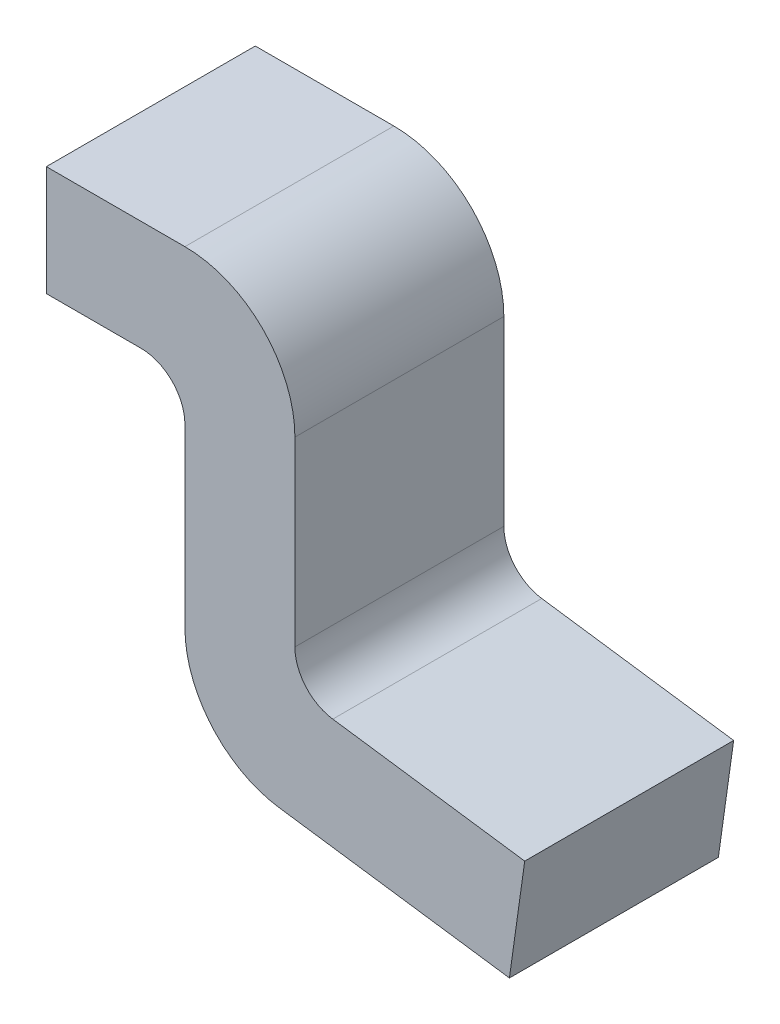
ISO-10303-21;
HEADER;
FILE_DESCRIPTION(('STEP AP214'),'2;1');
FILE_NAME('part.step','',(''),(''),'','','');
FILE_SCHEMA(('AUTOMOTIVE_DESIGN { 1 0 10303 214 1 1 1 1 }'));
ENDSEC;
DATA;
#1=APPLICATION_CONTEXT('core data for automotive mechanical design processes');
#2=APPLICATION_PROTOCOL_DEFINITION('international standard','automotive_design',2000,#1);
#3=PRODUCT_CONTEXT('',#1,'mechanical');
#4=PRODUCT('Part','Part','',(#3));
#5=PRODUCT_RELATED_PRODUCT_CATEGORY('part','',(#4));
#6=PRODUCT_DEFINITION_FORMATION('','',#4);
#7=PRODUCT_DEFINITION_CONTEXT('part definition',#1,'design');
#8=PRODUCT_DEFINITION('design','',#6,#7);
#9=PRODUCT_DEFINITION_SHAPE('','',#8);
#10=(LENGTH_UNIT() NAMED_UNIT(*) SI_UNIT(.MILLI.,.METRE.));
#11=(NAMED_UNIT(*) PLANE_ANGLE_UNIT() SI_UNIT($,.RADIAN.));
#12=(NAMED_UNIT(*) SI_UNIT($,.STERADIAN.) SOLID_ANGLE_UNIT());
#13=UNCERTAINTY_MEASURE_WITH_UNIT(LENGTH_MEASURE(1.E-05),#10,'distance_accuracy_value','');
#14=(GEOMETRIC_REPRESENTATION_CONTEXT(3) GLOBAL_UNCERTAINTY_ASSIGNED_CONTEXT((#13)) GLOBAL_UNIT_ASSIGNED_CONTEXT((#10,
#11,#12)) REPRESENTATION_CONTEXT('',''));
#15=CARTESIAN_POINT('',(0.,0.,0.));
#16=DIRECTION('',(0.,0.,1.));
#17=DIRECTION('',(1.,0.,0.));
#18=AXIS2_PLACEMENT_3D('',#15,#16,#17);
#19=CARTESIAN_POINT('',(0.675692646863,-0.546680467438,0.));
#20=DIRECTION('',(0.,0.,-1.));
#21=DIRECTION('',(-0.754709580222626,-0.656059028990675,0.));
#22=AXIS2_PLACEMENT_3D('',#19,#20,#21);
#23=CYLINDRICAL_SURFACE('',#22,0.1016);
#24=CARTESIAN_POINT('',(0.675692646863,-0.546680467438,0.2413));
#25=DIRECTION('',(0.,0.,1.));
#26=DIRECTION('',(-0.754709580222626,-0.656059028990675,0.));
#27=AXIS2_PLACEMENT_3D('',#24,#25,#26);
#28=CIRCLE('',#27,0.1016);
#29=CARTESIAN_POINT('',(0.574092646863,-0.546680467438,0.2413));
#30=VERTEX_POINT('',#29);
#31=CARTESIAN_POINT('',(0.661552659805,-0.647291703222,0.2413));
#32=VERTEX_POINT('',#31);
#33=EDGE_CURVE('E11',#30,#32,#28,.T.);
#34=ORIENTED_EDGE('',*,*,#33,.T.);
#35=DIRECTION('',(0.,0.,-1.));
#36=VECTOR('',#35,1.);
#37=CARTESIAN_POINT('',(0.661552659805,-0.647291703222,0.));
#38=LINE('',#37,#36);
#39=CARTESIAN_POINT('',(0.661552659805,-0.647291703222,-0.2413));
#40=VERTEX_POINT('',#39);
#41=EDGE_CURVE('E27',#32,#40,#38,.T.);
#42=ORIENTED_EDGE('',*,*,#41,.T.);
#43=CARTESIAN_POINT('',(0.675692646863,-0.546680467438,-0.2413));
#44=DIRECTION('',(0.,0.,-1.));
#45=DIRECTION('',(-0.754709580222626,-0.656059028990675,0.));
#46=AXIS2_PLACEMENT_3D('',#43,#44,#45);
#47=CIRCLE('',#46,0.1016);
#48=CARTESIAN_POINT('',(0.574092646863,-0.546680467438,-0.2413));
#49=VERTEX_POINT('',#48);
#50=EDGE_CURVE('E188',#40,#49,#47,.T.);
#51=ORIENTED_EDGE('',*,*,#50,.T.);
#52=DIRECTION('',(0.,0.,1.));
#53=VECTOR('',#52,1.);
#54=CARTESIAN_POINT('',(0.574092646863,-0.546680467438,0.));
#55=LINE('',#54,#53);
#56=EDGE_CURVE('E185',#49,#30,#55,.T.);
#57=ORIENTED_EDGE('',*,*,#56,.T.);
#58=EDGE_LOOP('',(#34,#42,#51,#57));
#59=FACE_BOUND('',#58,.T.);
#60=ADVANCED_FACE('F17',(#59),#23,.F.);
#61=CARTESIAN_POINT('',(1.1049,-0.709600108476,0.));
#62=DIRECTION('',(0.139173100959942,0.990268068741588,0.));
#63=DIRECTION('',(0.,0.,-1.));
#64=AXIS2_PLACEMENT_3D('',#61,#62,#63);
#65=PLANE('',#64);
#66=ORIENTED_EDGE('',*,*,#41,.F.);
#67=DIRECTION('',(-0.990268068741588,0.139173100959942,0.));
#68=VECTOR('',#67,1.);
#69=CARTESIAN_POINT('',(0.574092646863,-0.635,0.2413));
#70=LINE('',#69,#68);
#71=CARTESIAN_POINT('',(1.1049,-0.709600108476,0.2413));
#72=VERTEX_POINT('',#71);
#73=EDGE_CURVE('E159',#72,#32,#70,.T.);
#74=ORIENTED_EDGE('',*,*,#73,.F.);
#75=DIRECTION('',(0.,0.,-1.));
#76=VECTOR('',#75,1.);
#77=CARTESIAN_POINT('',(1.1049,-0.709600108476,0.));
#78=LINE('',#77,#76);
#79=CARTESIAN_POINT('',(1.1049,-0.709600108476,-0.2413));
#80=VERTEX_POINT('',#79);
#81=EDGE_CURVE('E189',#72,#80,#78,.T.);
#82=ORIENTED_EDGE('',*,*,#81,.T.);
#83=DIRECTION('',(0.990268068741588,-0.139173100959942,0.));
#84=VECTOR('',#83,1.);
#85=CARTESIAN_POINT('',(0.574092646863,-0.635,-0.2413));
#86=LINE('',#85,#84);
#87=EDGE_CURVE('E93',#40,#80,#86,.T.);
#88=ORIENTED_EDGE('',*,*,#87,.F.);
#89=EDGE_LOOP('',(#66,#74,#82,#88));
#90=FACE_BOUND('',#89,.T.);
#91=ADVANCED_FACE('F260',(#90),#65,.T.);
#92=CARTESIAN_POINT('',(0.218492646863,-0.2286,0.));
#93=DIRECTION('',(0.,0.,-1.));
#94=DIRECTION('',(0.707106781186548,0.707106781186548,0.));
#95=AXIS2_PLACEMENT_3D('',#92,#93,#94);
#96=CYLINDRICAL_SURFACE('',#95,0.1016);
#97=CARTESIAN_POINT('',(0.218492646863,-0.2286,0.2413));
#98=DIRECTION('',(0.,0.,1.));
#99=DIRECTION('',(0.707106781186548,0.707106781186548,0.));
#100=AXIS2_PLACEMENT_3D('',#97,#98,#99);
#101=CIRCLE('',#100,0.1016);
#102=CARTESIAN_POINT('',(0.320092646863,-0.2286,0.2413));
#103=VERTEX_POINT('',#102);
#104=CARTESIAN_POINT('',(0.218492646863,-0.127,0.2413));
#105=VERTEX_POINT('',#104);
#106=EDGE_CURVE('E210',#103,#105,#101,.T.);
#107=ORIENTED_EDGE('',*,*,#106,.T.);
#108=DIRECTION('',(0.,0.,-1.));
#109=VECTOR('',#108,1.);
#110=CARTESIAN_POINT('',(0.218492646863,-0.127,0.));
#111=LINE('',#110,#109);
#112=CARTESIAN_POINT('',(0.218492646863,-0.127,-0.2413));
#113=VERTEX_POINT('',#112);
#114=EDGE_CURVE('E105',#105,#113,#111,.T.);
#115=ORIENTED_EDGE('',*,*,#114,.T.);
#116=CARTESIAN_POINT('',(0.218492646863,-0.2286,-0.2413));
#117=DIRECTION('',(0.,0.,-1.));
#118=DIRECTION('',(0.707106781186548,0.707106781186548,0.));
#119=AXIS2_PLACEMENT_3D('',#116,#117,#118);
#120=CIRCLE('',#119,0.1016);
#121=CARTESIAN_POINT('',(0.320092646863,-0.2286,-0.2413));
#122=VERTEX_POINT('',#121);
#123=EDGE_CURVE('E204',#113,#122,#120,.T.);
#124=ORIENTED_EDGE('',*,*,#123,.T.);
#125=DIRECTION('',(0.,0.,1.));
#126=VECTOR('',#125,1.);
#127=CARTESIAN_POINT('',(0.320092646863,-0.2286,0.));
#128=LINE('',#127,#126);
#129=EDGE_CURVE('E200',#122,#103,#128,.T.);
#130=ORIENTED_EDGE('',*,*,#129,.T.);
#131=EDGE_LOOP('',(#107,#115,#124,#130));
#132=FACE_BOUND('',#131,.T.);
#133=ADVANCED_FACE('F262',(#132),#96,.F.);
#134=CARTESIAN_POINT('',(0.,-0.127,0.));
#135=DIRECTION('',(0.,-1.,0.));
#136=DIRECTION('',(0.,0.,-1.));
#137=AXIS2_PLACEMENT_3D('',#134,#135,#136);
#138=PLANE('',#137);
#139=ORIENTED_EDGE('',*,*,#114,.F.);
#140=DIRECTION('',(1.,0.,0.));
#141=VECTOR('',#140,1.);
#142=CARTESIAN_POINT('',(0.320092646863,-0.127,0.2413));
#143=LINE('',#142,#141);
#144=CARTESIAN_POINT('',(0.,-0.127,0.2413));
#145=VERTEX_POINT('',#144);
#146=EDGE_CURVE('E168',#145,#105,#143,.T.);
#147=ORIENTED_EDGE('',*,*,#146,.F.);
#148=DIRECTION('',(0.,0.,-1.));
#149=VECTOR('',#148,1.);
#150=CARTESIAN_POINT('',(0.,-0.127,0.));
#151=LINE('',#150,#149);
#152=CARTESIAN_POINT('',(0.,-0.127,-0.2413));
#153=VERTEX_POINT('',#152);
#154=EDGE_CURVE('E196',#145,#153,#151,.T.);
#155=ORIENTED_EDGE('',*,*,#154,.T.);
#156=DIRECTION('',(-1.,0.,0.));
#157=VECTOR('',#156,1.);
#158=CARTESIAN_POINT('',(0.320092646863,-0.127,-0.2413));
#159=LINE('',#158,#157);
#160=EDGE_CURVE('E179',#113,#153,#159,.T.);
#161=ORIENTED_EDGE('',*,*,#160,.F.);
#162=EDGE_LOOP('',(#139,#147,#155,#161));
#163=FACE_BOUND('',#162,.T.);
#164=ADVANCED_FACE('F269',(#163),#138,.T.);
#165=CARTESIAN_POINT('',(0.574092646863,-0.635,0.));
#166=DIRECTION('',(0.,0.,-1.));
#167=DIRECTION('',(-0.754709580222626,-0.656059028990675,0.));
#168=AXIS2_PLACEMENT_3D('',#165,#166,#167);
#169=CYLINDRICAL_SURFACE('',#168,0.254);
#170=CARTESIAN_POINT('',(0.574092646863,-0.635,-0.2413));
#171=DIRECTION('',(0.,0.,1.));
#172=DIRECTION('',(-0.754709580222626,-0.656059028990675,0.));
#173=AXIS2_PLACEMENT_3D('',#170,#171,#172);
#174=CIRCLE('',#173,0.254);
#175=CARTESIAN_POINT('',(0.320092646863,-0.635,-0.2413));
#176=VERTEX_POINT('',#175);
#177=CARTESIAN_POINT('',(0.538742679219,-0.88652808946,-0.2413));
#178=VERTEX_POINT('',#177);
#179=EDGE_CURVE('E140',#176,#178,#174,.T.);
#180=ORIENTED_EDGE('',*,*,#179,.T.);
#181=DIRECTION('',(0.,0.,1.));
#182=VECTOR('',#181,1.);
#183=CARTESIAN_POINT('',(0.538742679219,-0.88652808946,0.));
#184=LINE('',#183,#182);
#185=CARTESIAN_POINT('',(0.538742679219,-0.88652808946,0.2413));
#186=VERTEX_POINT('',#185);
#187=EDGE_CURVE('E134',#178,#186,#184,.T.);
#188=ORIENTED_EDGE('',*,*,#187,.T.);
#189=CARTESIAN_POINT('',(0.574092646863,-0.635,0.2413));
#190=DIRECTION('',(0.,0.,-1.));
#191=DIRECTION('',(-0.754709580222626,-0.656059028990675,0.));
#192=AXIS2_PLACEMENT_3D('',#189,#190,#191);
#193=CIRCLE('',#192,0.254);
#194=CARTESIAN_POINT('',(0.320092646863,-0.635,0.2413));
#195=VERTEX_POINT('',#194);
#196=EDGE_CURVE('E121',#186,#195,#193,.T.);
#197=ORIENTED_EDGE('',*,*,#196,.T.);
#198=DIRECTION('',(0.,0.,-1.));
#199=VECTOR('',#198,1.);
#200=CARTESIAN_POINT('',(0.320092646863,-0.635,0.));
#201=LINE('',#200,#199);
#202=EDGE_CURVE('E135',#195,#176,#201,.T.);
#203=ORIENTED_EDGE('',*,*,#202,.T.);
#204=EDGE_LOOP('',(#180,#188,#197,#203));
#205=FACE_BOUND('',#204,.T.);
#206=ADVANCED_FACE('F138',(#205),#169,.T.);
#207=CARTESIAN_POINT('',(0.320092646863,-0.855798831405,0.));
#208=DIRECTION('',(-0.139173100959942,-0.990268068741588,0.));
#209=DIRECTION('',(-0.990268068741588,0.139173100959942,0.));
#210=AXIS2_PLACEMENT_3D('',#207,#208,#209);
#211=PLANE('',#210);
#212=ORIENTED_EDGE('',*,*,#187,.F.);
#213=DIRECTION('',(-0.990268068741588,0.139173100959942,0.));
#214=VECTOR('',#213,1.);
#215=CARTESIAN_POINT('',(1.069550032356,-0.961128197936,-0.2413));
#216=LINE('',#215,#214);
#217=CARTESIAN_POINT('',(1.069550032356,-0.961128197936,-0.2413));
#218=VERTEX_POINT('',#217);
#219=EDGE_CURVE('E184',#218,#178,#216,.T.);
#220=ORIENTED_EDGE('',*,*,#219,.F.);
#221=DIRECTION('',(0.,0.,-1.));
#222=VECTOR('',#221,1.);
#223=CARTESIAN_POINT('',(1.069550032356,-0.961128197936,0.));
#224=LINE('',#223,#222);
#225=CARTESIAN_POINT('',(1.069550032356,-0.961128197936,0.2413));
#226=VERTEX_POINT('',#225);
#227=EDGE_CURVE('E147',#226,#218,#224,.T.);
#228=ORIENTED_EDGE('',*,*,#227,.F.);
#229=DIRECTION('',(0.990268068741588,-0.139173100959942,0.));
#230=VECTOR('',#229,1.);
#231=CARTESIAN_POINT('',(1.069550032356,-0.961128197936,0.2413));
#232=LINE('',#231,#230);
#233=EDGE_CURVE('E126',#186,#226,#232,.T.);
#234=ORIENTED_EDGE('',*,*,#233,.F.);
#235=EDGE_LOOP('',(#212,#220,#228,#234));
#236=FACE_BOUND('',#235,.T.);
#237=ADVANCED_FACE('F146',(#236),#211,.T.);
#238=CARTESIAN_POINT('',(0.510953388976,-0.425129121215,-0.2413));
#239=DIRECTION('',(0.,0.,-1.));
#240=DIRECTION('',(0.,-1.,0.));
#241=AXIS2_PLACEMENT_3D('',#238,#239,#240);
#242=PLANE('',#241);
#243=ORIENTED_EDGE('',*,*,#179,.F.);
#244=DIRECTION('',(0.,1.,0.));
#245=VECTOR('',#244,1.);
#246=CARTESIAN_POINT('',(0.320092646863,-0.855798831405,-0.2413));
#247=LINE('',#246,#245);
#248=EDGE_CURVE('E192',#176,#122,#247,.T.);
#249=ORIENTED_EDGE('',*,*,#248,.T.);
#250=ORIENTED_EDGE('',*,*,#123,.F.);
#251=ORIENTED_EDGE('',*,*,#160,.T.);
#252=DIRECTION('',(0.,1.,0.));
#253=VECTOR('',#252,1.);
#254=CARTESIAN_POINT('',(0.,-0.127,-0.2413));
#255=LINE('',#254,#253);
#256=CARTESIAN_POINT('',(0.,0.127,-0.2413));
#257=VERTEX_POINT('',#256);
#258=EDGE_CURVE('E175',#153,#257,#255,.T.);
#259=ORIENTED_EDGE('',*,*,#258,.T.);
#260=DIRECTION('',(1.,0.,0.));
#261=VECTOR('',#260,1.);
#262=CARTESIAN_POINT('',(0.,0.127,-0.2413));
#263=LINE('',#262,#261);
#264=CARTESIAN_POINT('',(0.320092646863,0.127,-0.2413));
#265=VERTEX_POINT('',#264);
#266=EDGE_CURVE('E180',#257,#265,#263,.T.);
#267=ORIENTED_EDGE('',*,*,#266,.T.);
#268=CARTESIAN_POINT('',(0.320092646863,-0.127,-0.2413));
#269=DIRECTION('',(0.,0.,1.));
#270=DIRECTION('',(0.707106781186548,0.707106781186548,0.));
#271=AXIS2_PLACEMENT_3D('',#268,#269,#270);
#272=CIRCLE('',#271,0.254);
#273=CARTESIAN_POINT('',(0.574092646863,-0.127,-0.2413));
#274=VERTEX_POINT('',#273);
#275=EDGE_CURVE('E231',#274,#265,#272,.T.);
#276=ORIENTED_EDGE('',*,*,#275,.F.);
#277=DIRECTION('',(0.,-1.,0.));
#278=VECTOR('',#277,1.);
#279=CARTESIAN_POINT('',(0.574092646863,0.127,-0.2413));
#280=LINE('',#279,#278);
#281=EDGE_CURVE('E207',#274,#49,#280,.T.);
#282=ORIENTED_EDGE('',*,*,#281,.T.);
#283=ORIENTED_EDGE('',*,*,#50,.F.);
#284=ORIENTED_EDGE('',*,*,#87,.T.);
#285=DIRECTION('',(-0.139173100959942,-0.990268068741588,0.));
#286=VECTOR('',#285,1.);
#287=CARTESIAN_POINT('',(1.1049,-0.709600108476,-0.2413));
#288=LINE('',#287,#286);
#289=EDGE_CURVE('E181',#80,#218,#288,.T.);
#290=ORIENTED_EDGE('',*,*,#289,.T.);
#291=ORIENTED_EDGE('',*,*,#219,.T.);
#292=EDGE_LOOP('',(#243,#249,#250,#251,#259,#267,#276,#282,#283,#284,#290,#291));
#293=FACE_BOUND('',#292,.T.);
#294=ADVANCED_FACE('F19',(#293),#242,.T.);
#295=CARTESIAN_POINT('',(0.320092646863,-0.127,0.));
#296=DIRECTION('',(0.,0.,-1.));
#297=DIRECTION('',(0.707106781186548,0.707106781186548,0.));
#298=AXIS2_PLACEMENT_3D('',#295,#296,#297);
#299=CYLINDRICAL_SURFACE('',#298,0.254);
#300=ORIENTED_EDGE('',*,*,#275,.T.);
#301=DIRECTION('',(0.,0.,1.));
#302=VECTOR('',#301,1.);
#303=CARTESIAN_POINT('',(0.320092646863,0.127,0.));
#304=LINE('',#303,#302);
#305=CARTESIAN_POINT('',(0.320092646863,0.127,0.2413));
#306=VERTEX_POINT('',#305);
#307=EDGE_CURVE('E218',#265,#306,#304,.T.);
#308=ORIENTED_EDGE('',*,*,#307,.T.);
#309=CARTESIAN_POINT('',(0.320092646863,-0.127,0.2413));
#310=DIRECTION('',(0.,0.,-1.));
#311=DIRECTION('',(0.707106781186548,0.707106781186548,0.));
#312=AXIS2_PLACEMENT_3D('',#309,#310,#311);
#313=CIRCLE('',#312,0.254);
#314=CARTESIAN_POINT('',(0.574092646863,-0.127,0.2413));
#315=VERTEX_POINT('',#314);
#316=EDGE_CURVE('E214',#306,#315,#313,.T.);
#317=ORIENTED_EDGE('',*,*,#316,.T.);
#318=DIRECTION('',(0.,0.,-1.));
#319=VECTOR('',#318,1.);
#320=CARTESIAN_POINT('',(0.574092646863,-0.127,0.));
#321=LINE('',#320,#319);
#322=EDGE_CURVE('E172',#315,#274,#321,.T.);
#323=ORIENTED_EDGE('',*,*,#322,.T.);
#324=EDGE_LOOP('',(#300,#308,#317,#323));
#325=FACE_BOUND('',#324,.T.);
#326=ADVANCED_FACE('F287',(#325),#299,.T.);
#327=CARTESIAN_POINT('',(0.574092646863,0.127,0.));
#328=DIRECTION('',(0.,1.,0.));
#329=DIRECTION('',(1.,0.,0.));
#330=AXIS2_PLACEMENT_3D('',#327,#328,#329);
#331=PLANE('',#330);
#332=ORIENTED_EDGE('',*,*,#307,.F.);
#333=ORIENTED_EDGE('',*,*,#266,.F.);
#334=DIRECTION('',(0.,0.,1.));
#335=VECTOR('',#334,1.);
#336=CARTESIAN_POINT('',(0.,0.127,0.));
#337=LINE('',#336,#335);
#338=CARTESIAN_POINT('',(0.,0.127,0.2413));
#339=VERTEX_POINT('',#338);
#340=EDGE_CURVE('E156',#257,#339,#337,.T.);
#341=ORIENTED_EDGE('',*,*,#340,.T.);
#342=DIRECTION('',(-1.,0.,0.));
#343=VECTOR('',#342,1.);
#344=CARTESIAN_POINT('',(0.,0.127,0.2413));
#345=LINE('',#344,#343);
#346=EDGE_CURVE('E167',#306,#339,#345,.T.);
#347=ORIENTED_EDGE('',*,*,#346,.F.);
#348=EDGE_LOOP('',(#332,#333,#341,#347));
#349=FACE_BOUND('',#348,.T.);
#350=ADVANCED_FACE('F284',(#349),#331,.T.);
#351=CARTESIAN_POINT('',(0.574092646863,-0.635,0.));
#352=DIRECTION('',(1.,0.,0.));
#353=DIRECTION('',(0.,-1.,0.));
#354=AXIS2_PLACEMENT_3D('',#351,#352,#353);
#355=PLANE('',#354);
#356=ORIENTED_EDGE('',*,*,#56,.F.);
#357=ORIENTED_EDGE('',*,*,#281,.F.);
#358=ORIENTED_EDGE('',*,*,#322,.F.);
#359=DIRECTION('',(0.,1.,0.));
#360=VECTOR('',#359,1.);
#361=CARTESIAN_POINT('',(0.574092646863,0.127,0.2413));
#362=LINE('',#361,#360);
#363=EDGE_CURVE('E222',#30,#315,#362,.T.);
#364=ORIENTED_EDGE('',*,*,#363,.F.);
#365=EDGE_LOOP('',(#356,#357,#358,#364));
#366=FACE_BOUND('',#365,.T.);
#367=ADVANCED_FACE('F281',(#366),#355,.T.);
#368=CARTESIAN_POINT('',(1.069550032356,-0.961128197936,0.));
#369=DIRECTION('',(0.990268068741588,-0.139173100959942,0.));
#370=DIRECTION('',(0.,0.,-1.));
#371=AXIS2_PLACEMENT_3D('',#368,#369,#370);
#372=PLANE('',#371);
#373=ORIENTED_EDGE('',*,*,#81,.F.);
#374=DIRECTION('',(0.139173100959942,0.990268068741588,0.));
#375=VECTOR('',#374,1.);
#376=CARTESIAN_POINT('',(1.1049,-0.709600108476,0.2413));
#377=LINE('',#376,#375);
#378=EDGE_CURVE('E150',#226,#72,#377,.T.);
#379=ORIENTED_EDGE('',*,*,#378,.F.);
#380=ORIENTED_EDGE('',*,*,#227,.T.);
#381=ORIENTED_EDGE('',*,*,#289,.F.);
#382=EDGE_LOOP('',(#373,#379,#380,#381));
#383=FACE_BOUND('',#382,.T.);
#384=ADVANCED_FACE('F257',(#383),#372,.T.);
#385=CARTESIAN_POINT('',(0.320092646863,-0.127,0.));
#386=DIRECTION('',(-1.,0.,0.));
#387=DIRECTION('',(0.,0.,1.));
#388=AXIS2_PLACEMENT_3D('',#385,#386,#387);
#389=PLANE('',#388);
#390=ORIENTED_EDGE('',*,*,#129,.F.);
#391=ORIENTED_EDGE('',*,*,#248,.F.);
#392=ORIENTED_EDGE('',*,*,#202,.F.);
#393=DIRECTION('',(0.,-1.,0.));
#394=VECTOR('',#393,1.);
#395=CARTESIAN_POINT('',(0.320092646863,-0.855798831405,0.2413));
#396=LINE('',#395,#394);
#397=EDGE_CURVE('E130',#103,#195,#396,.T.);
#398=ORIENTED_EDGE('',*,*,#397,.F.);
#399=EDGE_LOOP('',(#390,#391,#392,#398));
#400=FACE_BOUND('',#399,.T.);
#401=ADVANCED_FACE('F280',(#400),#389,.T.);
#402=CARTESIAN_POINT('',(0.,0.127,0.));
#403=DIRECTION('',(-1.,0.,0.));
#404=DIRECTION('',(0.,0.,1.));
#405=AXIS2_PLACEMENT_3D('',#402,#403,#404);
#406=PLANE('',#405);
#407=ORIENTED_EDGE('',*,*,#154,.F.);
#408=DIRECTION('',(0.,-1.,0.));
#409=VECTOR('',#408,1.);
#410=CARTESIAN_POINT('',(0.,-0.127,0.2413));
#411=LINE('',#410,#409);
#412=EDGE_CURVE('E164',#339,#145,#411,.T.);
#413=ORIENTED_EDGE('',*,*,#412,.F.);
#414=ORIENTED_EDGE('',*,*,#340,.F.);
#415=ORIENTED_EDGE('',*,*,#258,.F.);
#416=EDGE_LOOP('',(#407,#413,#414,#415));
#417=FACE_BOUND('',#416,.T.);
#418=ADVANCED_FACE('F276',(#417),#406,.T.);
#419=CARTESIAN_POINT('',(0.510953388976,-0.425129121215,0.2413));
#420=DIRECTION('',(0.,0.,1.));
#421=DIRECTION('',(1.,0.,0.));
#422=AXIS2_PLACEMENT_3D('',#419,#420,#421);
#423=PLANE('',#422);
#424=ORIENTED_EDGE('',*,*,#196,.F.);
#425=ORIENTED_EDGE('',*,*,#233,.T.);
#426=ORIENTED_EDGE('',*,*,#378,.T.);
#427=ORIENTED_EDGE('',*,*,#73,.T.);
#428=ORIENTED_EDGE('',*,*,#33,.F.);
#429=ORIENTED_EDGE('',*,*,#363,.T.);
#430=ORIENTED_EDGE('',*,*,#316,.F.);
#431=ORIENTED_EDGE('',*,*,#346,.T.);
#432=ORIENTED_EDGE('',*,*,#412,.T.);
#433=ORIENTED_EDGE('',*,*,#146,.T.);
#434=ORIENTED_EDGE('',*,*,#106,.F.);
#435=ORIENTED_EDGE('',*,*,#397,.T.);
#436=EDGE_LOOP('',(#424,#425,#426,#427,#428,#429,#430,#431,#432,#433,#434,#435));
#437=FACE_BOUND('',#436,.T.);
#438=ADVANCED_FACE('F123',(#437),#423,.T.);
#439=CLOSED_SHELL('',(#60,#91,#133,#164,#206,#237,#294,#326,#350,#367,#384,#401,#418,#438));
#440=MANIFOLD_SOLID_BREP('B1',#439);
#441=ADVANCED_BREP_SHAPE_REPRESENTATION('',(#18,#440),#14);
#442=SHAPE_DEFINITION_REPRESENTATION(#9,#441);
ENDSEC;
END-ISO-10303-21;
